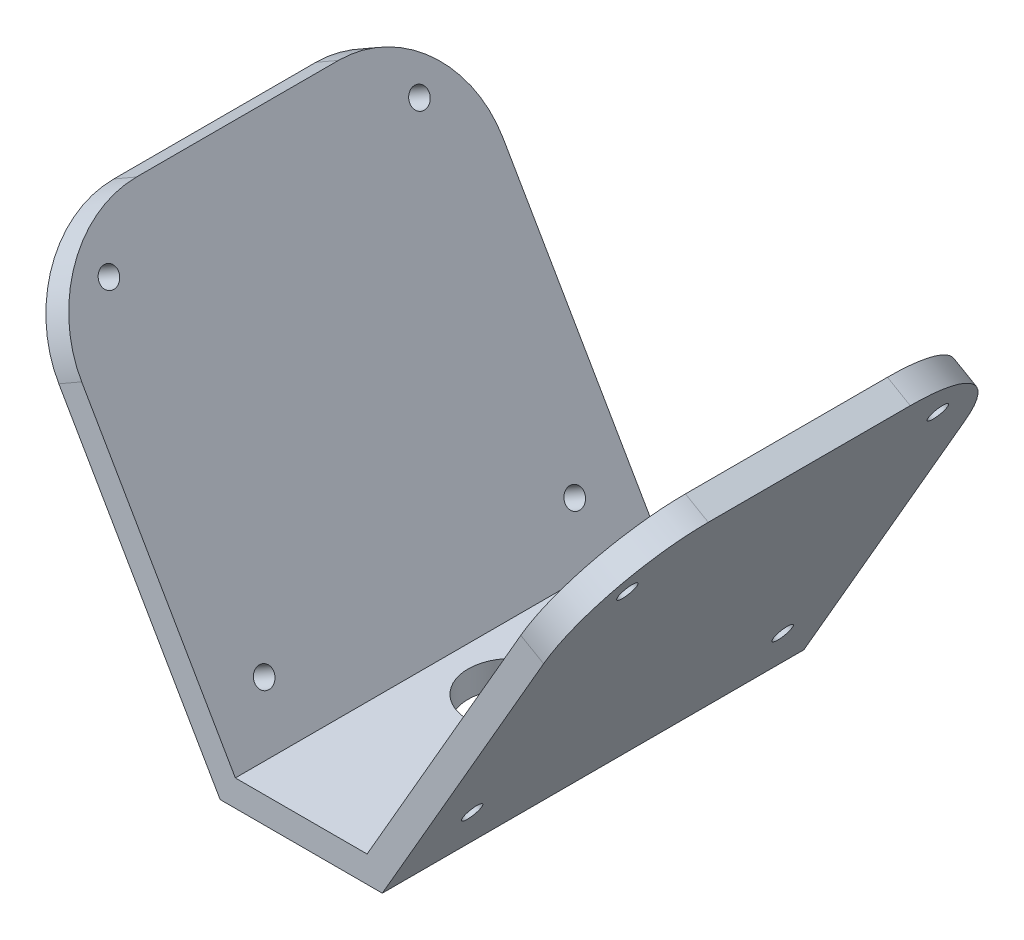
ISO-10303-21;
HEADER;
FILE_DESCRIPTION(('STEP AP214'),'2;1');
FILE_NAME('part.step','',(''),(''),'','','');
FILE_SCHEMA(('AUTOMOTIVE_DESIGN { 1 0 10303 214 1 1 1 1 }'));
ENDSEC;
DATA;
#1=APPLICATION_CONTEXT('core data for automotive mechanical design processes');
#2=APPLICATION_PROTOCOL_DEFINITION('international standard','automotive_design',2000,#1);
#3=PRODUCT_CONTEXT('',#1,'mechanical');
#4=PRODUCT('Part','Part','',(#3));
#5=PRODUCT_RELATED_PRODUCT_CATEGORY('part','',(#4));
#6=PRODUCT_DEFINITION_FORMATION('','',#4);
#7=PRODUCT_DEFINITION_CONTEXT('part definition',#1,'design');
#8=PRODUCT_DEFINITION('design','',#6,#7);
#9=PRODUCT_DEFINITION_SHAPE('','',#8);
#10=(LENGTH_UNIT() NAMED_UNIT(*) SI_UNIT(.MILLI.,.METRE.));
#11=(NAMED_UNIT(*) PLANE_ANGLE_UNIT() SI_UNIT($,.RADIAN.));
#12=(NAMED_UNIT(*) SI_UNIT($,.STERADIAN.) SOLID_ANGLE_UNIT());
#13=UNCERTAINTY_MEASURE_WITH_UNIT(LENGTH_MEASURE(1.E-05),#10,'distance_accuracy_value','');
#14=(GEOMETRIC_REPRESENTATION_CONTEXT(3) GLOBAL_UNCERTAINTY_ASSIGNED_CONTEXT((#13)) GLOBAL_UNIT_ASSIGNED_CONTEXT((#10,
#11,#12)) REPRESENTATION_CONTEXT('',''));
#15=CARTESIAN_POINT('',(0.,0.,0.));
#16=DIRECTION('',(0.,0.,1.));
#17=DIRECTION('',(1.,0.,0.));
#18=AXIS2_PLACEMENT_3D('',#15,#16,#17);
#19=CARTESIAN_POINT('',(-7.5,0.,-24.));
#20=DIRECTION('',(0.866025403784438,0.500000000000001,0.));
#21=DIRECTION('',(-0.500000000000001,0.866025403784438,0.));
#22=AXIS2_PLACEMENT_3D('',#19,#20,#21);
#23=PLANE('',#22);
#24=CARTESIAN_POINT('',(-28.2138347648319,35.8774142322752,-17.6776695296637));
#25=DIRECTION('',(0.866025403784438,0.500000000000001,0.));
#26=DIRECTION('',(-0.500000000000001,0.866025403784438,0.));
#27=AXIS2_PLACEMENT_3D('',#24,#25,#26);
#28=CIRCLE('',#27,1.1);
#29=CARTESIAN_POINT('',(-28.7638347648319,36.8300421764381,-17.6776695296637));
#30=VERTEX_POINT('',#29);
#31=EDGE_CURVE('E244',#30,#30,#28,.T.);
#32=ORIENTED_EDGE('',*,*,#31,.F.);
#33=EDGE_LOOP('',(#32));
#34=FACE_BOUND('',#33,.T.);
#35=CARTESIAN_POINT('',(-10.5361652351681,5.25879244748545,17.6776695296636));
#36=DIRECTION('',(0.866025403784438,0.500000000000001,0.));
#37=DIRECTION('',(-0.500000000000001,0.866025403784438,0.));
#38=AXIS2_PLACEMENT_3D('',#35,#36,#37);
#39=CIRCLE('',#38,1.09999999999999);
#40=CARTESIAN_POINT('',(-11.0861652351681,6.21142039164833,17.6776695296636));
#41=VERTEX_POINT('',#40);
#42=EDGE_CURVE('E246',#41,#41,#39,.T.);
#43=ORIENTED_EDGE('',*,*,#42,.F.);
#44=EDGE_LOOP('',(#43));
#45=FACE_BOUND('',#44,.T.);
#46=CARTESIAN_POINT('',(-28.2138347648319,35.8774142322753,17.6776695296636));
#47=DIRECTION('',(0.866025403784438,0.500000000000001,0.));
#48=DIRECTION('',(-0.500000000000001,0.866025403784438,0.));
#49=AXIS2_PLACEMENT_3D('',#46,#47,#48);
#50=CIRCLE('',#49,1.09999999999999);
#51=CARTESIAN_POINT('',(-28.7638347648319,36.8300421764382,17.6776695296636));
#52=VERTEX_POINT('',#51);
#53=EDGE_CURVE('E251',#52,#52,#50,.T.);
#54=ORIENTED_EDGE('',*,*,#53,.F.);
#55=EDGE_LOOP('',(#54));
#56=FACE_BOUND('',#55,.T.);
#57=CARTESIAN_POINT('',(-10.5361652351682,5.25879244748556,-17.6776695296637));
#58=DIRECTION('',(0.866025403784438,0.500000000000001,0.));
#59=DIRECTION('',(-0.500000000000001,0.866025403784438,0.));
#60=AXIS2_PLACEMENT_3D('',#57,#58,#59);
#61=CIRCLE('',#60,1.1);
#62=CARTESIAN_POINT('',(-11.0861652351682,6.21142039164844,-17.6776695296637));
#63=VERTEX_POINT('',#62);
#64=EDGE_CURVE('E254',#63,#63,#61,.T.);
#65=ORIENTED_EDGE('',*,*,#64,.F.);
#66=EDGE_LOOP('',(#65));
#67=FACE_BOUND('',#66,.T.);
#68=DIRECTION('',(0.,0.,1.));
#69=VECTOR('',#68,1.);
#70=CARTESIAN_POINT('',(-31.2500000000001,41.1362066797608,-24.));
#71=LINE('',#70,#69);
#72=CARTESIAN_POINT('',(-31.2500000000001,41.1362066797608,-11.5));
#73=VERTEX_POINT('',#72);
#74=CARTESIAN_POINT('',(-31.2500000000001,41.1362066797608,11.5));
#75=VERTEX_POINT('',#74);
#76=EDGE_CURVE('E182',#73,#75,#71,.T.);
#77=ORIENTED_EDGE('',*,*,#76,.T.);
#78=CARTESIAN_POINT('',(-25.,30.3108891324553,11.5));
#79=DIRECTION('',(0.866025403784438,0.500000000000001,0.));
#80=DIRECTION('',(-0.500000000000001,0.866025403784438,0.));
#81=AXIS2_PLACEMENT_3D('',#78,#79,#80);
#82=CIRCLE('',#81,12.5);
#83=CARTESIAN_POINT('',(-25.,30.3108891324553,24.));
#84=VERTEX_POINT('',#83);
#85=EDGE_CURVE('E212',#75,#84,#82,.T.);
#86=ORIENTED_EDGE('',*,*,#85,.T.);
#87=DIRECTION('',(-0.500000000000001,0.866025403784438,0.));
#88=VECTOR('',#87,1.);
#89=CARTESIAN_POINT('',(-7.5,0.,24.));
#90=LINE('',#89,#88);
#91=CARTESIAN_POINT('',(-7.5,0.,24.));
#92=VERTEX_POINT('',#91);
#93=EDGE_CURVE('E145',#92,#84,#90,.T.);
#94=ORIENTED_EDGE('',*,*,#93,.F.);
#95=DIRECTION('',(0.,0.,1.));
#96=VECTOR('',#95,1.);
#97=CARTESIAN_POINT('',(-7.5,0.,-24.));
#98=LINE('',#97,#96);
#99=CARTESIAN_POINT('',(-7.5,0.,-24.));
#100=VERTEX_POINT('',#99);
#101=EDGE_CURVE('E183',#100,#92,#98,.T.);
#102=ORIENTED_EDGE('',*,*,#101,.F.);
#103=DIRECTION('',(-0.500000000000001,0.866025403784438,0.));
#104=VECTOR('',#103,1.);
#105=CARTESIAN_POINT('',(-7.5,0.,-24.));
#106=LINE('',#105,#104);
#107=CARTESIAN_POINT('',(-25.,30.3108891324553,-24.));
#108=VERTEX_POINT('',#107);
#109=EDGE_CURVE('E169',#100,#108,#106,.T.);
#110=ORIENTED_EDGE('',*,*,#109,.T.);
#111=CARTESIAN_POINT('',(-25.,30.3108891324553,-11.5));
#112=DIRECTION('',(0.866025403784438,0.500000000000001,0.));
#113=DIRECTION('',(-0.500000000000001,0.866025403784438,0.));
#114=AXIS2_PLACEMENT_3D('',#111,#112,#113);
#115=CIRCLE('',#114,12.5);
#116=EDGE_CURVE('E210',#108,#73,#115,.T.);
#117=ORIENTED_EDGE('',*,*,#116,.T.);
#118=EDGE_LOOP('',(#77,#86,#94,#102,#110,#117));
#119=FACE_BOUND('',#118,.T.);
#120=ADVANCED_FACE('F41',(#34,#45,#56,#67,#119),#23,.T.);
#121=CARTESIAN_POINT('',(7.5,0.,-24.));
#122=DIRECTION('',(0.,1.,0.));
#123=DIRECTION('',(0.,0.,1.));
#124=AXIS2_PLACEMENT_3D('',#121,#122,#123);
#125=PLANE('',#124);
#126=CARTESIAN_POINT('',(0.,0.,0.));
#127=DIRECTION('',(0.,1.,0.));
#128=DIRECTION('',(0.,0.,1.));
#129=AXIS2_PLACEMENT_3D('',#126,#127,#128);
#130=CIRCLE('',#129,5.);
#131=CARTESIAN_POINT('',(0.,0.,5.));
#132=VERTEX_POINT('',#131);
#133=EDGE_CURVE('E293',#132,#132,#130,.T.);
#134=ORIENTED_EDGE('',*,*,#133,.F.);
#135=EDGE_LOOP('',(#134));
#136=FACE_BOUND('',#135,.T.);
#137=ORIENTED_EDGE('',*,*,#101,.T.);
#138=DIRECTION('',(-1.,0.,0.));
#139=VECTOR('',#138,1.);
#140=CARTESIAN_POINT('',(7.5,0.,24.));
#141=LINE('',#140,#139);
#142=CARTESIAN_POINT('',(7.5,0.,24.));
#143=VERTEX_POINT('',#142);
#144=EDGE_CURVE('E166',#143,#92,#141,.T.);
#145=ORIENTED_EDGE('',*,*,#144,.F.);
#146=DIRECTION('',(0.,0.,1.));
#147=VECTOR('',#146,1.);
#148=CARTESIAN_POINT('',(7.5,0.,-24.));
#149=LINE('',#148,#147);
#150=CARTESIAN_POINT('',(7.5,0.,-24.));
#151=VERTEX_POINT('',#150);
#152=EDGE_CURVE('E186',#151,#143,#149,.T.);
#153=ORIENTED_EDGE('',*,*,#152,.F.);
#154=DIRECTION('',(-1.,0.,0.));
#155=VECTOR('',#154,1.);
#156=CARTESIAN_POINT('',(7.5,0.,-24.));
#157=LINE('',#156,#155);
#158=EDGE_CURVE('E179',#151,#100,#157,.T.);
#159=ORIENTED_EDGE('',*,*,#158,.T.);
#160=EDGE_LOOP('',(#137,#145,#153,#159));
#161=FACE_BOUND('',#160,.T.);
#162=ADVANCED_FACE('F315',(#136,#161),#125,.T.);
#163=CARTESIAN_POINT('',(7.5,0.,-24.));
#164=DIRECTION('',(-0.866025403784438,0.500000000000001,0.));
#165=DIRECTION('',(-0.500000000000001,-0.866025403784438,0.));
#166=AXIS2_PLACEMENT_3D('',#163,#164,#165);
#167=PLANE('',#166);
#168=CARTESIAN_POINT('',(28.2138347648319,35.8774142322752,-17.6776695296637));
#169=DIRECTION('',(-0.866025403784438,0.500000000000001,0.));
#170=DIRECTION('',(-0.500000000000001,-0.866025403784438,0.));
#171=AXIS2_PLACEMENT_3D('',#168,#169,#170);
#172=CIRCLE('',#171,1.1);
#173=CARTESIAN_POINT('',(27.6638347648319,34.9247862881123,-17.6776695296637));
#174=VERTEX_POINT('',#173);
#175=EDGE_CURVE('E265',#174,#174,#172,.F.);
#176=ORIENTED_EDGE('',*,*,#175,.T.);
#177=EDGE_LOOP('',(#176));
#178=FACE_BOUND('',#177,.T.);
#179=CARTESIAN_POINT('',(10.5361652351681,5.25879244748545,17.6776695296636));
#180=DIRECTION('',(-0.866025403784438,0.500000000000001,0.));
#181=DIRECTION('',(-0.500000000000001,-0.866025403784438,0.));
#182=AXIS2_PLACEMENT_3D('',#179,#180,#181);
#183=CIRCLE('',#182,1.09999999999999);
#184=CARTESIAN_POINT('',(9.98616523516811,4.30616450332258,17.6776695296636));
#185=VERTEX_POINT('',#184);
#186=EDGE_CURVE('E272',#185,#185,#183,.F.);
#187=ORIENTED_EDGE('',*,*,#186,.T.);
#188=EDGE_LOOP('',(#187));
#189=FACE_BOUND('',#188,.T.);
#190=CARTESIAN_POINT('',(28.2138347648319,35.8774142322753,17.6776695296636));
#191=DIRECTION('',(-0.866025403784438,0.500000000000001,0.));
#192=DIRECTION('',(-0.500000000000001,-0.866025403784438,0.));
#193=AXIS2_PLACEMENT_3D('',#190,#191,#192);
#194=CIRCLE('',#193,1.09999999999999);
#195=CARTESIAN_POINT('',(27.6638347648319,34.9247862881125,17.6776695296636));
#196=VERTEX_POINT('',#195);
#197=EDGE_CURVE('E275',#196,#196,#194,.F.);
#198=ORIENTED_EDGE('',*,*,#197,.T.);
#199=EDGE_LOOP('',(#198));
#200=FACE_BOUND('',#199,.T.);
#201=CARTESIAN_POINT('',(10.5361652351682,5.25879244748556,-17.6776695296637));
#202=DIRECTION('',(-0.866025403784438,0.500000000000001,0.));
#203=DIRECTION('',(-0.500000000000001,-0.866025403784438,0.));
#204=AXIS2_PLACEMENT_3D('',#201,#202,#203);
#205=CIRCLE('',#204,1.1);
#206=CARTESIAN_POINT('',(9.98616523516817,4.30616450332268,-17.6776695296637));
#207=VERTEX_POINT('',#206);
#208=EDGE_CURVE('E278',#207,#207,#205,.F.);
#209=ORIENTED_EDGE('',*,*,#208,.T.);
#210=EDGE_LOOP('',(#209));
#211=FACE_BOUND('',#210,.T.);
#212=DIRECTION('',(-0.500000000000001,-0.866025403784438,0.));
#213=VECTOR('',#212,1.);
#214=CARTESIAN_POINT('',(7.5,0.,24.));
#215=LINE('',#214,#213);
#216=CARTESIAN_POINT('',(25.,30.3108891324553,24.));
#217=VERTEX_POINT('',#216);
#218=EDGE_CURVE('E161',#217,#143,#215,.T.);
#219=ORIENTED_EDGE('',*,*,#218,.F.);
#220=CARTESIAN_POINT('',(25.,30.3108891324553,11.5));
#221=DIRECTION('',(-0.866025403784438,0.500000000000001,0.));
#222=DIRECTION('',(-0.500000000000001,-0.866025403784438,0.));
#223=AXIS2_PLACEMENT_3D('',#220,#221,#222);
#224=CIRCLE('',#223,12.5);
#225=CARTESIAN_POINT('',(31.2500000000001,41.1362066797608,11.5));
#226=VERTEX_POINT('',#225);
#227=EDGE_CURVE('E216',#217,#226,#224,.T.);
#228=ORIENTED_EDGE('',*,*,#227,.T.);
#229=DIRECTION('',(0.,0.,1.));
#230=VECTOR('',#229,1.);
#231=CARTESIAN_POINT('',(31.2500000000001,41.1362066797608,-24.));
#232=LINE('',#231,#230);
#233=CARTESIAN_POINT('',(31.2500000000001,41.1362066797608,-11.5));
#234=VERTEX_POINT('',#233);
#235=EDGE_CURVE('E189',#234,#226,#232,.T.);
#236=ORIENTED_EDGE('',*,*,#235,.F.);
#237=CARTESIAN_POINT('',(25.,30.3108891324553,-11.5));
#238=DIRECTION('',(-0.866025403784438,0.500000000000001,0.));
#239=DIRECTION('',(-0.500000000000001,-0.866025403784438,0.));
#240=AXIS2_PLACEMENT_3D('',#237,#238,#239);
#241=CIRCLE('',#240,12.5);
#242=CARTESIAN_POINT('',(25.,30.3108891324553,-24.));
#243=VERTEX_POINT('',#242);
#244=EDGE_CURVE('E214',#234,#243,#241,.T.);
#245=ORIENTED_EDGE('',*,*,#244,.T.);
#246=DIRECTION('',(-0.500000000000001,-0.866025403784438,0.));
#247=VECTOR('',#246,1.);
#248=CARTESIAN_POINT('',(7.5,0.,-24.));
#249=LINE('',#248,#247);
#250=EDGE_CURVE('E177',#243,#151,#249,.T.);
#251=ORIENTED_EDGE('',*,*,#250,.T.);
#252=ORIENTED_EDGE('',*,*,#152,.T.);
#253=EDGE_LOOP('',(#219,#228,#236,#245,#251,#252));
#254=FACE_BOUND('',#253,.T.);
#255=ADVANCED_FACE('F321',(#178,#189,#200,#211,#254),#167,.T.);
#256=CARTESIAN_POINT('',(31.2500000000001,41.1362066797608,-24.));
#257=DIRECTION('',(0.5,0.866025403784439,0.));
#258=DIRECTION('',(-0.866025403784439,0.5,0.));
#259=AXIS2_PLACEMENT_3D('',#256,#257,#258);
#260=PLANE('',#259);
#261=ORIENTED_EDGE('',*,*,#235,.T.);
#262=DIRECTION('',(-0.866025403784439,0.5,0.));
#263=VECTOR('',#262,1.);
#264=CARTESIAN_POINT('',(31.2500000000001,41.1362066797608,11.5));
#265=LINE('',#264,#263);
#266=CARTESIAN_POINT('',(33.8480762113534,39.6362066797608,11.5));
#267=VERTEX_POINT('',#266);
#268=EDGE_CURVE('E63',#226,#267,#265,.F.);
#269=ORIENTED_EDGE('',*,*,#268,.T.);
#270=DIRECTION('',(0.,0.,1.));
#271=VECTOR('',#270,1.);
#272=CARTESIAN_POINT('',(33.8480762113534,39.6362066797608,-24.));
#273=LINE('',#272,#271);
#274=CARTESIAN_POINT('',(33.8480762113534,39.6362066797608,-11.5));
#275=VERTEX_POINT('',#274);
#276=EDGE_CURVE('E191',#275,#267,#273,.T.);
#277=ORIENTED_EDGE('',*,*,#276,.F.);
#278=DIRECTION('',(-0.866025403784439,0.5,0.));
#279=VECTOR('',#278,1.);
#280=CARTESIAN_POINT('',(31.2500000000001,41.1362066797608,-11.5));
#281=LINE('',#280,#279);
#282=EDGE_CURVE('E218',#275,#234,#281,.T.);
#283=ORIENTED_EDGE('',*,*,#282,.T.);
#284=EDGE_LOOP('',(#261,#269,#277,#283));
#285=FACE_BOUND('',#284,.T.);
#286=ADVANCED_FACE('F311',(#285),#260,.T.);
#287=CARTESIAN_POINT('',(33.8480762113534,39.6362066797608,-24.));
#288=DIRECTION('',(0.866025403784438,-0.500000000000001,0.));
#289=DIRECTION('',(0.500000000000001,0.866025403784438,0.));
#290=AXIS2_PLACEMENT_3D('',#287,#288,#289);
#291=PLANE('',#290);
#292=CARTESIAN_POINT('',(30.8119109761852,34.3774142322752,-17.6776695296637));
#293=DIRECTION('',(-0.866025403784438,0.500000000000002,0.));
#294=DIRECTION('',(0.500000000000001,0.866025403784438,0.));
#295=AXIS2_PLACEMENT_3D('',#292,#293,#294);
#296=CIRCLE('',#295,1.1);
#297=CARTESIAN_POINT('',(31.3619109761852,35.3300421764381,-17.6776695296637));
#298=VERTEX_POINT('',#297);
#299=EDGE_CURVE('E285',#298,#298,#296,.T.);
#300=ORIENTED_EDGE('',*,*,#299,.T.);
#301=EDGE_LOOP('',(#300));
#302=FACE_BOUND('',#301,.T.);
#303=CARTESIAN_POINT('',(13.1342414465214,3.75879244748546,17.6776695296636));
#304=DIRECTION('',(-0.866025403784438,0.500000000000002,0.));
#305=DIRECTION('',(0.500000000000001,0.866025403784438,0.));
#306=AXIS2_PLACEMENT_3D('',#303,#304,#305);
#307=CIRCLE('',#306,1.09999999999999);
#308=CARTESIAN_POINT('',(13.6842414465214,4.71142039164833,17.6776695296636));
#309=VERTEX_POINT('',#308);
#310=EDGE_CURVE('E288',#309,#309,#307,.T.);
#311=ORIENTED_EDGE('',*,*,#310,.T.);
#312=EDGE_LOOP('',(#311));
#313=FACE_BOUND('',#312,.T.);
#314=CARTESIAN_POINT('',(30.8119109761852,34.3774142322753,17.6776695296636));
#315=DIRECTION('',(-0.866025403784438,0.500000000000002,0.));
#316=DIRECTION('',(-0.500000000000001,-0.866025403784438,0.));
#317=AXIS2_PLACEMENT_3D('',#314,#315,#316);
#318=CIRCLE('',#317,1.09999999999999);
#319=CARTESIAN_POINT('',(30.2619109761852,33.4247862881125,17.6776695296636));
#320=VERTEX_POINT('',#319);
#321=EDGE_CURVE('E284',#320,#320,#318,.T.);
#322=ORIENTED_EDGE('',*,*,#321,.T.);
#323=EDGE_LOOP('',(#322));
#324=FACE_BOUND('',#323,.T.);
#325=CARTESIAN_POINT('',(13.1342414465215,3.75879244748557,-17.6776695296637));
#326=DIRECTION('',(-0.866025403784438,0.500000000000002,0.));
#327=DIRECTION('',(-0.500000000000001,-0.866025403784438,0.));
#328=AXIS2_PLACEMENT_3D('',#325,#326,#327);
#329=CIRCLE('',#328,1.1);
#330=CARTESIAN_POINT('',(12.5842414465215,2.80616450332269,-17.6776695296637));
#331=VERTEX_POINT('',#330);
#332=EDGE_CURVE('E281',#331,#331,#329,.T.);
#333=ORIENTED_EDGE('',*,*,#332,.T.);
#334=EDGE_LOOP('',(#333));
#335=FACE_BOUND('',#334,.T.);
#336=ORIENTED_EDGE('',*,*,#276,.T.);
#337=CARTESIAN_POINT('',(27.5980762113534,28.8108891324553,11.5));
#338=DIRECTION('',(0.866025403784438,-0.500000000000001,0.));
#339=DIRECTION('',(0.500000000000001,0.866025403784438,0.));
#340=AXIS2_PLACEMENT_3D('',#337,#338,#339);
#341=CIRCLE('',#340,12.5);
#342=CARTESIAN_POINT('',(27.5980762113534,28.8108891324553,24.));
#343=VERTEX_POINT('',#342);
#344=EDGE_CURVE('E224',#267,#343,#341,.T.);
#345=ORIENTED_EDGE('',*,*,#344,.T.);
#346=DIRECTION('',(0.500000000000001,0.866025403784438,0.));
#347=VECTOR('',#346,1.);
#348=CARTESIAN_POINT('',(33.8480762113534,39.6362066797608,24.));
#349=LINE('',#348,#347);
#350=CARTESIAN_POINT('',(9.23205080756886,-3.,24.));
#351=VERTEX_POINT('',#350);
#352=EDGE_CURVE('E159',#351,#343,#349,.T.);
#353=ORIENTED_EDGE('',*,*,#352,.F.);
#354=DIRECTION('',(0.,0.,1.));
#355=VECTOR('',#354,1.);
#356=CARTESIAN_POINT('',(9.23205080756886,-3.,-24.));
#357=LINE('',#356,#355);
#358=CARTESIAN_POINT('',(9.23205080756886,-3.,-24.));
#359=VERTEX_POINT('',#358);
#360=EDGE_CURVE('E155',#359,#351,#357,.T.);
#361=ORIENTED_EDGE('',*,*,#360,.F.);
#362=DIRECTION('',(0.500000000000001,0.866025403784438,0.));
#363=VECTOR('',#362,1.);
#364=CARTESIAN_POINT('',(33.8480762113534,39.6362066797608,-24.));
#365=LINE('',#364,#363);
#366=CARTESIAN_POINT('',(27.5980762113534,28.8108891324553,-24.));
#367=VERTEX_POINT('',#366);
#368=EDGE_CURVE('E175',#359,#367,#365,.T.);
#369=ORIENTED_EDGE('',*,*,#368,.T.);
#370=CARTESIAN_POINT('',(27.5980762113534,28.8108891324553,-11.5));
#371=DIRECTION('',(0.866025403784438,-0.500000000000001,0.));
#372=DIRECTION('',(0.500000000000001,0.866025403784438,0.));
#373=AXIS2_PLACEMENT_3D('',#370,#371,#372);
#374=CIRCLE('',#373,12.5);
#375=EDGE_CURVE('E222',#367,#275,#374,.T.);
#376=ORIENTED_EDGE('',*,*,#375,.T.);
#377=EDGE_LOOP('',(#336,#345,#353,#361,#369,#376));
#378=FACE_BOUND('',#377,.T.);
#379=ADVANCED_FACE('F303',(#302,#313,#324,#335,#378),#291,.T.);
#380=CARTESIAN_POINT('',(-9.23205080756885,-3.,-24.));
#381=DIRECTION('',(0.,-1.,0.));
#382=DIRECTION('',(0.,0.,-1.));
#383=AXIS2_PLACEMENT_3D('',#380,#381,#382);
#384=PLANE('',#383);
#385=CARTESIAN_POINT('',(0.,-3.,0.));
#386=DIRECTION('',(0.,-1.,0.));
#387=DIRECTION('',(0.,0.,-1.));
#388=AXIS2_PLACEMENT_3D('',#385,#386,#387);
#389=CIRCLE('',#388,5.);
#390=CARTESIAN_POINT('',(0.,-3.,-5.));
#391=VERTEX_POINT('',#390);
#392=EDGE_CURVE('E45',#391,#391,#389,.T.);
#393=ORIENTED_EDGE('',*,*,#392,.F.);
#394=EDGE_LOOP('',(#393));
#395=FACE_BOUND('',#394,.T.);
#396=ORIENTED_EDGE('',*,*,#360,.T.);
#397=DIRECTION('',(1.,0.,0.));
#398=VECTOR('',#397,1.);
#399=CARTESIAN_POINT('',(-9.23205080756885,-3.,24.));
#400=LINE('',#399,#398);
#401=CARTESIAN_POINT('',(-9.23205080756885,-3.,24.));
#402=VERTEX_POINT('',#401);
#403=EDGE_CURVE('E140',#402,#351,#400,.T.);
#404=ORIENTED_EDGE('',*,*,#403,.F.);
#405=DIRECTION('',(0.,0.,1.));
#406=VECTOR('',#405,1.);
#407=CARTESIAN_POINT('',(-9.23205080756885,-3.,-24.));
#408=LINE('',#407,#406);
#409=CARTESIAN_POINT('',(-9.23205080756885,-3.,-24.));
#410=VERTEX_POINT('',#409);
#411=EDGE_CURVE('E148',#410,#402,#408,.T.);
#412=ORIENTED_EDGE('',*,*,#411,.F.);
#413=DIRECTION('',(1.,0.,0.));
#414=VECTOR('',#413,1.);
#415=CARTESIAN_POINT('',(-9.23205080756885,-3.,-24.));
#416=LINE('',#415,#414);
#417=EDGE_CURVE('E173',#410,#359,#416,.T.);
#418=ORIENTED_EDGE('',*,*,#417,.T.);
#419=EDGE_LOOP('',(#396,#404,#412,#418));
#420=FACE_BOUND('',#419,.T.);
#421=ADVANCED_FACE('F158',(#395,#420),#384,.T.);
#422=CARTESIAN_POINT('',(-33.8480762113534,39.6362066797608,-24.));
#423=DIRECTION('',(-0.866025403784438,-0.500000000000001,0.));
#424=DIRECTION('',(0.500000000000001,-0.866025403784438,0.));
#425=AXIS2_PLACEMENT_3D('',#422,#423,#424);
#426=PLANE('',#425);
#427=CARTESIAN_POINT('',(-30.8119109761852,34.3774142322752,-17.6776695296637));
#428=DIRECTION('',(-0.866025403784438,-0.500000000000002,0.));
#429=DIRECTION('',(-0.500000000000001,0.866025403784438,0.));
#430=AXIS2_PLACEMENT_3D('',#427,#428,#429);
#431=CIRCLE('',#430,1.1);
#432=CARTESIAN_POINT('',(-31.3619109761852,35.3300421764381,-17.6776695296637));
#433=VERTEX_POINT('',#432);
#434=EDGE_CURVE('E261',#433,#433,#431,.T.);
#435=ORIENTED_EDGE('',*,*,#434,.F.);
#436=EDGE_LOOP('',(#435));
#437=FACE_BOUND('',#436,.T.);
#438=CARTESIAN_POINT('',(-13.1342414465214,3.75879244748546,17.6776695296636));
#439=DIRECTION('',(-0.866025403784438,-0.500000000000002,0.));
#440=DIRECTION('',(-0.500000000000001,0.866025403784438,0.));
#441=AXIS2_PLACEMENT_3D('',#438,#439,#440);
#442=CIRCLE('',#441,1.09999999999999);
#443=CARTESIAN_POINT('',(-13.6842414465214,4.71142039164833,17.6776695296636));
#444=VERTEX_POINT('',#443);
#445=EDGE_CURVE('E264',#444,#444,#442,.T.);
#446=ORIENTED_EDGE('',*,*,#445,.F.);
#447=EDGE_LOOP('',(#446));
#448=FACE_BOUND('',#447,.T.);
#449=CARTESIAN_POINT('',(-30.8119109761852,34.3774142322753,17.6776695296636));
#450=DIRECTION('',(-0.866025403784438,-0.500000000000002,0.));
#451=DIRECTION('',(0.500000000000001,-0.866025403784438,0.));
#452=AXIS2_PLACEMENT_3D('',#449,#450,#451);
#453=CIRCLE('',#452,1.09999999999999);
#454=CARTESIAN_POINT('',(-30.2619109761852,33.4247862881125,17.6776695296636));
#455=VERTEX_POINT('',#454);
#456=EDGE_CURVE('E260',#455,#455,#453,.T.);
#457=ORIENTED_EDGE('',*,*,#456,.F.);
#458=EDGE_LOOP('',(#457));
#459=FACE_BOUND('',#458,.T.);
#460=CARTESIAN_POINT('',(-13.1342414465215,3.75879244748557,-17.6776695296637));
#461=DIRECTION('',(-0.866025403784438,-0.500000000000002,0.));
#462=DIRECTION('',(0.500000000000001,-0.866025403784438,0.));
#463=AXIS2_PLACEMENT_3D('',#460,#461,#462);
#464=CIRCLE('',#463,1.1);
#465=CARTESIAN_POINT('',(-12.5842414465215,2.80616450332269,-17.6776695296637));
#466=VERTEX_POINT('',#465);
#467=EDGE_CURVE('E257',#466,#466,#464,.T.);
#468=ORIENTED_EDGE('',*,*,#467,.F.);
#469=EDGE_LOOP('',(#468));
#470=FACE_BOUND('',#469,.T.);
#471=DIRECTION('',(0.500000000000001,-0.866025403784438,0.));
#472=VECTOR('',#471,1.);
#473=CARTESIAN_POINT('',(-33.8480762113534,39.6362066797608,24.));
#474=LINE('',#473,#472);
#475=CARTESIAN_POINT('',(-27.5980762113534,28.8108891324553,24.));
#476=VERTEX_POINT('',#475);
#477=EDGE_CURVE('E134',#476,#402,#474,.T.);
#478=ORIENTED_EDGE('',*,*,#477,.F.);
#479=CARTESIAN_POINT('',(-27.5980762113534,28.8108891324553,11.5));
#480=DIRECTION('',(-0.866025403784438,-0.500000000000001,0.));
#481=DIRECTION('',(0.500000000000001,-0.866025403784438,0.));
#482=AXIS2_PLACEMENT_3D('',#479,#480,#481);
#483=CIRCLE('',#482,12.5);
#484=CARTESIAN_POINT('',(-33.8480762113534,39.6362066797608,11.5));
#485=VERTEX_POINT('',#484);
#486=EDGE_CURVE('E203',#476,#485,#483,.T.);
#487=ORIENTED_EDGE('',*,*,#486,.T.);
#488=DIRECTION('',(0.,0.,1.));
#489=VECTOR('',#488,1.);
#490=CARTESIAN_POINT('',(-33.8480762113534,39.6362066797608,-24.));
#491=LINE('',#490,#489);
#492=CARTESIAN_POINT('',(-33.8480762113534,39.6362066797608,-11.5));
#493=VERTEX_POINT('',#492);
#494=EDGE_CURVE('E156',#493,#485,#491,.T.);
#495=ORIENTED_EDGE('',*,*,#494,.F.);
#496=CARTESIAN_POINT('',(-27.5980762113534,28.8108891324553,-11.5));
#497=DIRECTION('',(-0.866025403784438,-0.500000000000001,0.));
#498=DIRECTION('',(0.500000000000001,-0.866025403784438,0.));
#499=AXIS2_PLACEMENT_3D('',#496,#497,#498);
#500=CIRCLE('',#499,12.5);
#501=CARTESIAN_POINT('',(-27.5980762113534,28.8108891324553,-24.));
#502=VERTEX_POINT('',#501);
#503=EDGE_CURVE('E201',#493,#502,#500,.T.);
#504=ORIENTED_EDGE('',*,*,#503,.T.);
#505=DIRECTION('',(0.500000000000001,-0.866025403784438,0.));
#506=VECTOR('',#505,1.);
#507=CARTESIAN_POINT('',(-33.8480762113534,39.6362066797608,-24.));
#508=LINE('',#507,#506);
#509=EDGE_CURVE('E151',#502,#410,#508,.T.);
#510=ORIENTED_EDGE('',*,*,#509,.T.);
#511=ORIENTED_EDGE('',*,*,#411,.T.);
#512=EDGE_LOOP('',(#478,#487,#495,#504,#510,#511));
#513=FACE_BOUND('',#512,.T.);
#514=ADVANCED_FACE('F149',(#437,#448,#459,#470,#513),#426,.T.);
#515=CARTESIAN_POINT('',(-31.2500000000001,41.1362066797608,-24.));
#516=DIRECTION('',(-0.5,0.866025403784439,0.));
#517=DIRECTION('',(-0.866025403784439,-0.5,0.));
#518=AXIS2_PLACEMENT_3D('',#515,#516,#517);
#519=PLANE('',#518);
#520=ORIENTED_EDGE('',*,*,#494,.T.);
#521=DIRECTION('',(-0.866025403784439,-0.5,0.));
#522=VECTOR('',#521,1.);
#523=CARTESIAN_POINT('',(-31.2500000000001,41.1362066797608,11.5));
#524=LINE('',#523,#522);
#525=EDGE_CURVE('E208',#485,#75,#524,.F.);
#526=ORIENTED_EDGE('',*,*,#525,.T.);
#527=ORIENTED_EDGE('',*,*,#76,.F.);
#528=DIRECTION('',(-0.866025403784439,-0.5,0.));
#529=VECTOR('',#528,1.);
#530=CARTESIAN_POINT('',(-33.8480762113534,39.6362066797608,-11.5));
#531=LINE('',#530,#529);
#532=EDGE_CURVE('E205',#73,#493,#531,.T.);
#533=ORIENTED_EDGE('',*,*,#532,.T.);
#534=EDGE_LOOP('',(#520,#526,#527,#533));
#535=FACE_BOUND('',#534,.T.);
#536=ADVANCED_FACE('F238',(#535),#519,.T.);
#537=CARTESIAN_POINT('',(0.,0.,-24.));
#538=DIRECTION('',(0.,0.,1.));
#539=DIRECTION('',(1.,0.,0.));
#540=AXIS2_PLACEMENT_3D('',#537,#538,#539);
#541=PLANE('',#540);
#542=ORIENTED_EDGE('',*,*,#250,.F.);
#543=DIRECTION('',(-0.866025403784439,0.5,0.));
#544=VECTOR('',#543,1.);
#545=CARTESIAN_POINT('',(27.5980762113534,28.8108891324553,-24.));
#546=LINE('',#545,#544);
#547=EDGE_CURVE('E11',#243,#367,#546,.F.);
#548=ORIENTED_EDGE('',*,*,#547,.T.);
#549=ORIENTED_EDGE('',*,*,#368,.F.);
#550=ORIENTED_EDGE('',*,*,#417,.F.);
#551=ORIENTED_EDGE('',*,*,#509,.F.);
#552=DIRECTION('',(-0.866025403784439,-0.5,0.));
#553=VECTOR('',#552,1.);
#554=CARTESIAN_POINT('',(-25.0000000000001,30.3108891324553,-24.));
#555=LINE('',#554,#553);
#556=EDGE_CURVE('E50',#502,#108,#555,.F.);
#557=ORIENTED_EDGE('',*,*,#556,.T.);
#558=ORIENTED_EDGE('',*,*,#109,.F.);
#559=ORIENTED_EDGE('',*,*,#158,.F.);
#560=EDGE_LOOP('',(#542,#548,#549,#550,#551,#557,#558,#559));
#561=FACE_BOUND('',#560,.T.);
#562=ADVANCED_FACE('F228',(#561),#541,.F.);
#563=CARTESIAN_POINT('',(0.,0.,24.));
#564=DIRECTION('',(0.,0.,1.));
#565=DIRECTION('',(1.,0.,0.));
#566=AXIS2_PLACEMENT_3D('',#563,#564,#565);
#567=PLANE('',#566);
#568=ORIENTED_EDGE('',*,*,#93,.T.);
#569=DIRECTION('',(-0.866025403784439,-0.5,0.));
#570=VECTOR('',#569,1.);
#571=CARTESIAN_POINT('',(-19.375,33.558484396647,24.));
#572=LINE('',#571,#570);
#573=EDGE_CURVE('E143',#84,#476,#572,.T.);
#574=ORIENTED_EDGE('',*,*,#573,.T.);
#575=ORIENTED_EDGE('',*,*,#477,.T.);
#576=ORIENTED_EDGE('',*,*,#403,.T.);
#577=ORIENTED_EDGE('',*,*,#352,.T.);
#578=DIRECTION('',(-0.866025403784439,0.5,0.));
#579=VECTOR('',#578,1.);
#580=CARTESIAN_POINT('',(19.375,33.558484396647,24.));
#581=LINE('',#580,#579);
#582=EDGE_CURVE('E185',#343,#217,#581,.T.);
#583=ORIENTED_EDGE('',*,*,#582,.T.);
#584=ORIENTED_EDGE('',*,*,#218,.T.);
#585=ORIENTED_EDGE('',*,*,#144,.T.);
#586=EDGE_LOOP('',(#568,#574,#575,#576,#577,#583,#584,#585));
#587=FACE_BOUND('',#586,.T.);
#588=ADVANCED_FACE('F137',(#587),#567,.T.);
#589=CARTESIAN_POINT('',(-8.80411442759928,6.25879244748558,-17.6776695296637));
#590=DIRECTION('',(-0.866025403784438,-0.500000000000002,0.));
#591=DIRECTION('',(0.500000000000002,-0.866025403784438,0.));
#592=AXIS2_PLACEMENT_3D('',#589,#590,#591);
#593=CYLINDRICAL_SURFACE('',#592,1.1);
#594=ORIENTED_EDGE('',*,*,#64,.T.);
#595=EDGE_LOOP('',(#594));
#596=FACE_BOUND('',#595,.T.);
#597=ORIENTED_EDGE('',*,*,#467,.T.);
#598=EDGE_LOOP('',(#597));
#599=FACE_BOUND('',#598,.T.);
#600=ADVANCED_FACE('F364',(#596,#599),#593,.F.);
#601=CARTESIAN_POINT('',(-26.4817839572631,36.8774142322753,17.6776695296636));
#602=DIRECTION('',(-0.866025403784438,-0.500000000000002,0.));
#603=DIRECTION('',(0.500000000000002,-0.866025403784438,0.));
#604=AXIS2_PLACEMENT_3D('',#601,#602,#603);
#605=CYLINDRICAL_SURFACE('',#604,1.09999999999999);
#606=ORIENTED_EDGE('',*,*,#53,.T.);
#607=EDGE_LOOP('',(#606));
#608=FACE_BOUND('',#607,.T.);
#609=ORIENTED_EDGE('',*,*,#456,.T.);
#610=EDGE_LOOP('',(#609));
#611=FACE_BOUND('',#610,.T.);
#612=ADVANCED_FACE('F367',(#608,#611),#605,.F.);
#613=CARTESIAN_POINT('',(-8.80411442759922,6.25879244748546,17.6776695296636));
#614=DIRECTION('',(-0.866025403784438,-0.500000000000002,0.));
#615=DIRECTION('',(0.500000000000002,-0.866025403784438,0.));
#616=AXIS2_PLACEMENT_3D('',#613,#614,#615);
#617=CYLINDRICAL_SURFACE('',#616,1.09999999999999);
#618=ORIENTED_EDGE('',*,*,#42,.T.);
#619=EDGE_LOOP('',(#618));
#620=FACE_BOUND('',#619,.T.);
#621=ORIENTED_EDGE('',*,*,#445,.T.);
#622=EDGE_LOOP('',(#621));
#623=FACE_BOUND('',#622,.T.);
#624=ADVANCED_FACE('F371',(#620,#623),#617,.F.);
#625=CARTESIAN_POINT('',(-26.481783957263,36.8774142322752,-17.6776695296637));
#626=DIRECTION('',(-0.866025403784438,-0.500000000000002,0.));
#627=DIRECTION('',(0.500000000000002,-0.866025403784438,0.));
#628=AXIS2_PLACEMENT_3D('',#625,#626,#627);
#629=CYLINDRICAL_SURFACE('',#628,1.1);
#630=ORIENTED_EDGE('',*,*,#31,.T.);
#631=EDGE_LOOP('',(#630));
#632=FACE_BOUND('',#631,.T.);
#633=ORIENTED_EDGE('',*,*,#434,.T.);
#634=EDGE_LOOP('',(#633));
#635=FACE_BOUND('',#634,.T.);
#636=ADVANCED_FACE('F331',(#632,#635),#629,.F.);
#637=CARTESIAN_POINT('',(-19.375,33.558484396647,11.5));
#638=DIRECTION('',(-0.866025403784439,-0.5,0.));
#639=DIRECTION('',(0.5,-0.866025403784439,0.));
#640=AXIS2_PLACEMENT_3D('',#637,#638,#639);
#641=CYLINDRICAL_SURFACE('',#640,12.5);
#642=ORIENTED_EDGE('',*,*,#85,.F.);
#643=ORIENTED_EDGE('',*,*,#525,.F.);
#644=ORIENTED_EDGE('',*,*,#486,.F.);
#645=ORIENTED_EDGE('',*,*,#573,.F.);
#646=EDGE_LOOP('',(#642,#643,#644,#645));
#647=FACE_BOUND('',#646,.T.);
#648=ADVANCED_FACE('F242',(#647),#641,.T.);
#649=CARTESIAN_POINT('',(19.375,33.558484396647,11.5));
#650=DIRECTION('',(-0.866025403784439,0.5,0.));
#651=DIRECTION('',(-0.5,-0.866025403784439,0.));
#652=AXIS2_PLACEMENT_3D('',#649,#650,#651);
#653=CYLINDRICAL_SURFACE('',#652,12.5);
#654=ORIENTED_EDGE('',*,*,#344,.F.);
#655=ORIENTED_EDGE('',*,*,#268,.F.);
#656=ORIENTED_EDGE('',*,*,#227,.F.);
#657=ORIENTED_EDGE('',*,*,#582,.F.);
#658=EDGE_LOOP('',(#654,#655,#656,#657));
#659=FACE_BOUND('',#658,.T.);
#660=ADVANCED_FACE('F330',(#659),#653,.T.);
#661=CARTESIAN_POINT('',(25.0000000000001,30.3108891324553,-11.5));
#662=DIRECTION('',(0.866025403784439,-0.5,0.));
#663=DIRECTION('',(0.5,0.866025403784439,0.));
#664=AXIS2_PLACEMENT_3D('',#661,#662,#663);
#665=CYLINDRICAL_SURFACE('',#664,12.5);
#666=ORIENTED_EDGE('',*,*,#375,.F.);
#667=ORIENTED_EDGE('',*,*,#547,.F.);
#668=ORIENTED_EDGE('',*,*,#244,.F.);
#669=ORIENTED_EDGE('',*,*,#282,.F.);
#670=EDGE_LOOP('',(#666,#667,#668,#669));
#671=FACE_BOUND('',#670,.T.);
#672=ADVANCED_FACE('F333',(#671),#665,.T.);
#673=CARTESIAN_POINT('',(-25.0000000000001,30.3108891324553,-11.5));
#674=DIRECTION('',(0.866025403784439,0.5,0.));
#675=DIRECTION('',(-0.5,0.866025403784439,0.));
#676=AXIS2_PLACEMENT_3D('',#673,#674,#675);
#677=CYLINDRICAL_SURFACE('',#676,12.5);
#678=ORIENTED_EDGE('',*,*,#116,.F.);
#679=ORIENTED_EDGE('',*,*,#556,.F.);
#680=ORIENTED_EDGE('',*,*,#503,.F.);
#681=ORIENTED_EDGE('',*,*,#532,.F.);
#682=EDGE_LOOP('',(#678,#679,#680,#681));
#683=FACE_BOUND('',#682,.T.);
#684=ADVANCED_FACE('F43',(#683),#677,.T.);
#685=CARTESIAN_POINT('',(8.80411442759928,6.25879244748558,-17.6776695296637));
#686=DIRECTION('',(0.866025403784438,-0.500000000000002,0.));
#687=DIRECTION('',(0.500000000000002,0.866025403784438,0.));
#688=AXIS2_PLACEMENT_3D('',#685,#686,#687);
#689=CYLINDRICAL_SURFACE('',#688,1.1);
#690=ORIENTED_EDGE('',*,*,#208,.F.);
#691=EDGE_LOOP('',(#690));
#692=FACE_BOUND('',#691,.T.);
#693=ORIENTED_EDGE('',*,*,#332,.F.);
#694=EDGE_LOOP('',(#693));
#695=FACE_BOUND('',#694,.T.);
#696=ADVANCED_FACE('F340',(#692,#695),#689,.F.);
#697=CARTESIAN_POINT('',(26.4817839572631,36.8774142322753,17.6776695296636));
#698=DIRECTION('',(0.866025403784438,-0.500000000000002,0.));
#699=DIRECTION('',(0.500000000000002,0.866025403784438,0.));
#700=AXIS2_PLACEMENT_3D('',#697,#698,#699);
#701=CYLINDRICAL_SURFACE('',#700,1.09999999999999);
#702=ORIENTED_EDGE('',*,*,#197,.F.);
#703=EDGE_LOOP('',(#702));
#704=FACE_BOUND('',#703,.T.);
#705=ORIENTED_EDGE('',*,*,#321,.F.);
#706=EDGE_LOOP('',(#705));
#707=FACE_BOUND('',#706,.T.);
#708=ADVANCED_FACE('F381',(#704,#707),#701,.F.);
#709=CARTESIAN_POINT('',(8.80411442759922,6.25879244748546,17.6776695296636));
#710=DIRECTION('',(0.866025403784438,-0.500000000000002,0.));
#711=DIRECTION('',(0.500000000000002,0.866025403784438,0.));
#712=AXIS2_PLACEMENT_3D('',#709,#710,#711);
#713=CYLINDRICAL_SURFACE('',#712,1.09999999999999);
#714=ORIENTED_EDGE('',*,*,#186,.F.);
#715=EDGE_LOOP('',(#714));
#716=FACE_BOUND('',#715,.T.);
#717=ORIENTED_EDGE('',*,*,#310,.F.);
#718=EDGE_LOOP('',(#717));
#719=FACE_BOUND('',#718,.T.);
#720=ADVANCED_FACE('F386',(#716,#719),#713,.F.);
#721=CARTESIAN_POINT('',(26.481783957263,36.8774142322752,-17.6776695296637));
#722=DIRECTION('',(0.866025403784438,-0.500000000000002,0.));
#723=DIRECTION('',(0.500000000000002,0.866025403784438,0.));
#724=AXIS2_PLACEMENT_3D('',#721,#722,#723);
#725=CYLINDRICAL_SURFACE('',#724,1.1);
#726=ORIENTED_EDGE('',*,*,#175,.F.);
#727=EDGE_LOOP('',(#726));
#728=FACE_BOUND('',#727,.T.);
#729=ORIENTED_EDGE('',*,*,#299,.F.);
#730=EDGE_LOOP('',(#729));
#731=FACE_BOUND('',#730,.T.);
#732=ADVANCED_FACE('F383',(#728,#731),#725,.F.);
#733=CARTESIAN_POINT('',(0.,-10.,0.));
#734=DIRECTION('',(0.,1.,0.));
#735=DIRECTION('',(0.,0.,1.));
#736=AXIS2_PLACEMENT_3D('',#733,#734,#735);
#737=CYLINDRICAL_SURFACE('',#736,5.);
#738=ORIENTED_EDGE('',*,*,#392,.T.);
#739=EDGE_LOOP('',(#738));
#740=FACE_BOUND('',#739,.T.);
#741=ORIENTED_EDGE('',*,*,#133,.T.);
#742=EDGE_LOOP('',(#741));
#743=FACE_BOUND('',#742,.T.);
#744=ADVANCED_FACE('F300',(#740,#743),#737,.F.);
#745=CLOSED_SHELL('',(#120,#162,#255,#286,#379,#421,#514,#536,#562,#588,#600,#612,#624,#636,
#648,#660,#672,#684,#696,#708,#720,#732,#744));
#746=MANIFOLD_SOLID_BREP('B2',#745);
#747=ADVANCED_BREP_SHAPE_REPRESENTATION('',(#18,#746),#14);
#748=SHAPE_DEFINITION_REPRESENTATION(#9,#747);
ENDSEC;
END-ISO-10303-21;
